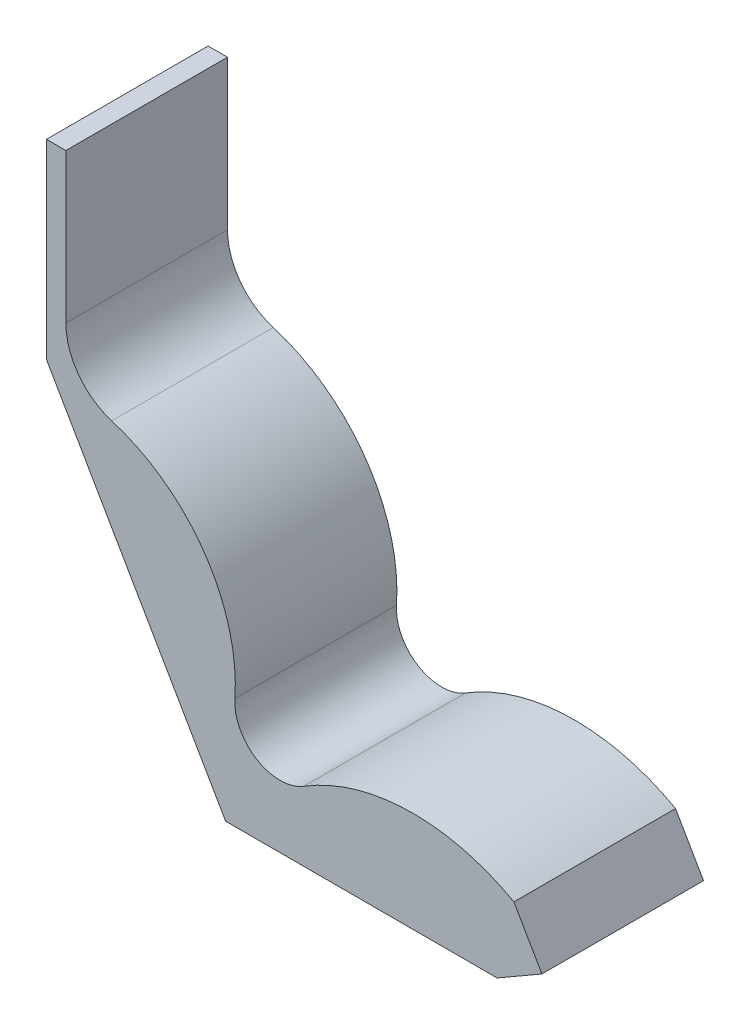
ISO-10303-21;
HEADER;
FILE_DESCRIPTION(('STEP AP214'),'2;1');
FILE_NAME('part.step','',(''),(''),'','','');
FILE_SCHEMA(('AUTOMOTIVE_DESIGN { 1 0 10303 214 1 1 1 1 }'));
ENDSEC;
DATA;
#1=APPLICATION_CONTEXT('core data for automotive mechanical design processes');
#2=APPLICATION_PROTOCOL_DEFINITION('international standard','automotive_design',2000,#1);
#3=PRODUCT_CONTEXT('',#1,'mechanical');
#4=PRODUCT('Part','Part','',(#3));
#5=PRODUCT_RELATED_PRODUCT_CATEGORY('part','',(#4));
#6=PRODUCT_DEFINITION_FORMATION('','',#4);
#7=PRODUCT_DEFINITION_CONTEXT('part definition',#1,'design');
#8=PRODUCT_DEFINITION('design','',#6,#7);
#9=PRODUCT_DEFINITION_SHAPE('','',#8);
#10=(LENGTH_UNIT() NAMED_UNIT(*) SI_UNIT(.MILLI.,.METRE.));
#11=(NAMED_UNIT(*) PLANE_ANGLE_UNIT() SI_UNIT($,.RADIAN.));
#12=(NAMED_UNIT(*) SI_UNIT($,.STERADIAN.) SOLID_ANGLE_UNIT());
#13=UNCERTAINTY_MEASURE_WITH_UNIT(LENGTH_MEASURE(1.E-05),#10,'distance_accuracy_value','');
#14=(GEOMETRIC_REPRESENTATION_CONTEXT(3) GLOBAL_UNCERTAINTY_ASSIGNED_CONTEXT((#13)) GLOBAL_UNIT_ASSIGNED_CONTEXT((#10,
#11,#12)) REPRESENTATION_CONTEXT('',''));
#15=CARTESIAN_POINT('',(0.,0.,0.));
#16=DIRECTION('',(0.,0.,1.));
#17=DIRECTION('',(1.,0.,0.));
#18=AXIS2_PLACEMENT_3D('',#15,#16,#17);
#19=CARTESIAN_POINT('',(-277.128129211019,480.,250.));
#20=DIRECTION('',(1.,0.,0.));
#21=DIRECTION('',(0.,1.,0.));
#22=AXIS2_PLACEMENT_3D('',#19,#20,#21);
#23=PLANE('',#22);
#24=DIRECTION('',(0.,-1.,0.));
#25=VECTOR('',#24,1.);
#26=CARTESIAN_POINT('',(-277.128129211019,480.,0.));
#27=LINE('',#26,#25);
#28=CARTESIAN_POINT('',(-277.128129211019,775.,0.));
#29=VERTEX_POINT('',#28);
#30=CARTESIAN_POINT('',(-277.128129211019,480.,0.));
#31=VERTEX_POINT('',#30);
#32=EDGE_CURVE('E152',#29,#31,#27,.T.);
#33=ORIENTED_EDGE('',*,*,#32,.T.);
#34=DIRECTION('',(0.,0.,-1.));
#35=VECTOR('',#34,1.);
#36=CARTESIAN_POINT('',(-277.128129211019,480.,250.));
#37=LINE('',#36,#35);
#38=CARTESIAN_POINT('',(-277.128129211019,480.,250.));
#39=VERTEX_POINT('',#38);
#40=EDGE_CURVE('E11',#39,#31,#37,.T.);
#41=ORIENTED_EDGE('',*,*,#40,.F.);
#42=DIRECTION('',(0.,-1.,0.));
#43=VECTOR('',#42,1.);
#44=CARTESIAN_POINT('',(-277.128129211019,480.,250.));
#45=LINE('',#44,#43);
#46=CARTESIAN_POINT('',(-277.128129211019,775.,250.));
#47=VERTEX_POINT('',#46);
#48=EDGE_CURVE('E172',#47,#39,#45,.T.);
#49=ORIENTED_EDGE('',*,*,#48,.F.);
#50=DIRECTION('',(0.,0.,-1.));
#51=VECTOR('',#50,1.);
#52=CARTESIAN_POINT('',(-277.128129211019,775.,250.));
#53=LINE('',#52,#51);
#54=EDGE_CURVE('E148',#47,#29,#53,.T.);
#55=ORIENTED_EDGE('',*,*,#54,.T.);
#56=EDGE_LOOP('',(#33,#41,#49,#55));
#57=FACE_BOUND('',#56,.T.);
#58=ADVANCED_FACE('F38',(#57),#23,.F.);
#59=CARTESIAN_POINT('',(-277.128129211019,480.,250.));
#60=DIRECTION('',(0.86602540378444,0.499999999999998,0.));
#61=DIRECTION('',(-0.499999999999998,0.86602540378444,0.));
#62=AXIS2_PLACEMENT_3D('',#59,#60,#61);
#63=PLANE('',#62);
#64=DIRECTION('',(0.499999999999998,-0.86602540378444,0.));
#65=VECTOR('',#64,1.);
#66=CARTESIAN_POINT('',(-277.128129211019,480.,0.));
#67=LINE('',#66,#65);
#68=CARTESIAN_POINT('',(0.,0.,0.));
#69=VERTEX_POINT('',#68);
#70=EDGE_CURVE('E155',#31,#69,#67,.T.);
#71=ORIENTED_EDGE('',*,*,#70,.T.);
#72=DIRECTION('',(0.,0.,-1.));
#73=VECTOR('',#72,1.);
#74=CARTESIAN_POINT('',(0.,0.,250.));
#75=LINE('',#74,#73);
#76=CARTESIAN_POINT('',(0.,0.,250.));
#77=VERTEX_POINT('',#76);
#78=EDGE_CURVE('E46',#77,#69,#75,.T.);
#79=ORIENTED_EDGE('',*,*,#78,.F.);
#80=DIRECTION('',(0.499999999999998,-0.86602540378444,0.));
#81=VECTOR('',#80,1.);
#82=CARTESIAN_POINT('',(-277.128129211019,480.,250.));
#83=LINE('',#82,#81);
#84=EDGE_CURVE('E106',#39,#77,#83,.T.);
#85=ORIENTED_EDGE('',*,*,#84,.F.);
#86=ORIENTED_EDGE('',*,*,#40,.T.);
#87=EDGE_LOOP('',(#71,#79,#85,#86));
#88=FACE_BOUND('',#87,.T.);
#89=ADVANCED_FACE('F244',(#88),#63,.F.);
#90=CARTESIAN_POINT('',(0.,0.,250.));
#91=DIRECTION('',(0.,1.,0.));
#92=DIRECTION('',(0.,0.,1.));
#93=AXIS2_PLACEMENT_3D('',#90,#91,#92);
#94=PLANE('',#93);
#95=DIRECTION('',(1.,0.,0.));
#96=VECTOR('',#95,1.);
#97=CARTESIAN_POINT('',(0.,0.,0.));
#98=LINE('',#97,#96);
#99=CARTESIAN_POINT('',(420.,0.,0.));
#100=VERTEX_POINT('',#99);
#101=EDGE_CURVE('E157',#69,#100,#98,.T.);
#102=ORIENTED_EDGE('',*,*,#101,.T.);
#103=DIRECTION('',(0.,0.,-1.));
#104=VECTOR('',#103,1.);
#105=CARTESIAN_POINT('',(420.,0.,250.));
#106=LINE('',#105,#104);
#107=CARTESIAN_POINT('',(420.,0.,250.));
#108=VERTEX_POINT('',#107);
#109=EDGE_CURVE('E188',#108,#100,#106,.T.);
#110=ORIENTED_EDGE('',*,*,#109,.F.);
#111=DIRECTION('',(1.,0.,0.));
#112=VECTOR('',#111,1.);
#113=CARTESIAN_POINT('',(0.,0.,250.));
#114=LINE('',#113,#112);
#115=EDGE_CURVE('E196',#77,#108,#114,.T.);
#116=ORIENTED_EDGE('',*,*,#115,.F.);
#117=ORIENTED_EDGE('',*,*,#78,.T.);
#118=EDGE_LOOP('',(#102,#110,#116,#117));
#119=FACE_BOUND('',#118,.T.);
#120=ADVANCED_FACE('F194',(#119),#94,.F.);
#121=CARTESIAN_POINT('',(420.,0.,250.));
#122=DIRECTION('',(-0.500000000000002,0.866025403784438,0.));
#123=DIRECTION('',(-0.866025403784438,-0.500000000000002,0.));
#124=AXIS2_PLACEMENT_3D('',#121,#122,#123);
#125=PLANE('',#124);
#126=DIRECTION('',(0.866025403784438,0.500000000000002,0.));
#127=VECTOR('',#126,1.);
#128=CARTESIAN_POINT('',(420.,0.,0.));
#129=LINE('',#128,#127);
#130=CARTESIAN_POINT('',(489.282032302755,40.0000000000001,0.));
#131=VERTEX_POINT('',#130);
#132=EDGE_CURVE('E159',#100,#131,#129,.T.);
#133=ORIENTED_EDGE('',*,*,#132,.T.);
#134=DIRECTION('',(0.,0.,-1.));
#135=VECTOR('',#134,1.);
#136=CARTESIAN_POINT('',(489.282032302755,40.0000000000001,250.));
#137=LINE('',#136,#135);
#138=CARTESIAN_POINT('',(489.282032302755,40.0000000000001,250.));
#139=VERTEX_POINT('',#138);
#140=EDGE_CURVE('E185',#139,#131,#137,.T.);
#141=ORIENTED_EDGE('',*,*,#140,.F.);
#142=DIRECTION('',(0.866025403784438,0.500000000000002,0.));
#143=VECTOR('',#142,1.);
#144=CARTESIAN_POINT('',(420.,0.,250.));
#145=LINE('',#144,#143);
#146=EDGE_CURVE('E214',#108,#139,#145,.T.);
#147=ORIENTED_EDGE('',*,*,#146,.F.);
#148=ORIENTED_EDGE('',*,*,#109,.T.);
#149=EDGE_LOOP('',(#133,#141,#147,#148));
#150=FACE_BOUND('',#149,.T.);
#151=ADVANCED_FACE('F205',(#150),#125,.F.);
#152=CARTESIAN_POINT('',(489.282032302755,40.0000000000001,250.));
#153=DIRECTION('',(-0.866025403784438,-0.500000000000001,0.));
#154=DIRECTION('',(0.500000000000001,-0.866025403784438,0.));
#155=AXIS2_PLACEMENT_3D('',#152,#153,#154);
#156=PLANE('',#155);
#157=DIRECTION('',(-0.500000000000001,0.866025403784438,0.));
#158=VECTOR('',#157,1.);
#159=CARTESIAN_POINT('',(489.282032302755,40.0000000000001,0.));
#160=LINE('',#159,#158);
#161=CARTESIAN_POINT('',(445.980762113533,115.,0.));
#162=VERTEX_POINT('',#161);
#163=EDGE_CURVE('E161',#131,#162,#160,.T.);
#164=ORIENTED_EDGE('',*,*,#163,.T.);
#165=DIRECTION('',(0.,0.,-1.));
#166=VECTOR('',#165,1.);
#167=CARTESIAN_POINT('',(445.980762113533,115.,250.));
#168=LINE('',#167,#166);
#169=CARTESIAN_POINT('',(445.980762113533,115.,250.));
#170=VERTEX_POINT('',#169);
#171=EDGE_CURVE('E182',#170,#162,#168,.T.);
#172=ORIENTED_EDGE('',*,*,#171,.F.);
#173=DIRECTION('',(-0.500000000000001,0.866025403784438,0.));
#174=VECTOR('',#173,1.);
#175=CARTESIAN_POINT('',(489.282032302755,40.0000000000001,250.));
#176=LINE('',#175,#174);
#177=EDGE_CURVE('E211',#139,#170,#176,.T.);
#178=ORIENTED_EDGE('',*,*,#177,.F.);
#179=ORIENTED_EDGE('',*,*,#140,.T.);
#180=EDGE_LOOP('',(#164,#172,#178,#179));
#181=FACE_BOUND('',#180,.T.);
#182=ADVANCED_FACE('F209',(#181),#156,.F.);
#183=CARTESIAN_POINT('',(290.,-164.410096185663,250.));
#184=DIRECTION('',(0.,0.,-1.));
#185=DIRECTION('',(-1.,0.,0.));
#186=AXIS2_PLACEMENT_3D('',#183,#184,#185);
#187=CYLINDRICAL_SURFACE('',#186,320.);
#188=CARTESIAN_POINT('',(290.,-164.410096185663,0.));
#189=DIRECTION('',(0.,0.,1.));
#190=DIRECTION('',(1.,0.,0.));
#191=AXIS2_PLACEMENT_3D('',#188,#189,#190);
#192=CIRCLE('',#191,320.);
#193=CARTESIAN_POINT('',(121.149011162266,107.415847330624,0.));
#194=VERTEX_POINT('',#193);
#195=EDGE_CURVE('E163',#162,#194,#192,.T.);
#196=ORIENTED_EDGE('',*,*,#195,.T.);
#197=DIRECTION('',(0.,0.,-1.));
#198=VECTOR('',#197,1.);
#199=CARTESIAN_POINT('',(121.149011162266,107.415847330624,250.));
#200=LINE('',#199,#198);
#201=CARTESIAN_POINT('',(121.149011162266,107.415847330624,250.));
#202=VERTEX_POINT('',#201);
#203=EDGE_CURVE('E179',#202,#194,#200,.T.);
#204=ORIENTED_EDGE('',*,*,#203,.F.);
#205=CARTESIAN_POINT('',(290.,-164.410096185663,250.));
#206=DIRECTION('',(0.,0.,1.));
#207=DIRECTION('',(1.,0.,0.));
#208=AXIS2_PLACEMENT_3D('',#205,#206,#207);
#209=CIRCLE('',#208,320.);
#210=EDGE_CURVE('E213',#170,#202,#209,.T.);
#211=ORIENTED_EDGE('',*,*,#210,.F.);
#212=ORIENTED_EDGE('',*,*,#171,.T.);
#213=EDGE_LOOP('',(#196,#204,#211,#212));
#214=FACE_BOUND('',#213,.T.);
#215=ADVANCED_FACE('F257',(#214),#187,.T.);
#216=CARTESIAN_POINT('',(84.2128573540122,166.877772474812,250.));
#217=DIRECTION('',(0.,0.,-1.));
#218=DIRECTION('',(-1.,0.,0.));
#219=AXIS2_PLACEMENT_3D('',#216,#217,#218);
#220=CYLINDRICAL_SURFACE('',#219,70.);
#221=CARTESIAN_POINT('',(84.2128573540122,166.877772474812,0.));
#222=DIRECTION('',(0.,0.,-1.));
#223=DIRECTION('',(1.,0.,0.));
#224=AXIS2_PLACEMENT_3D('',#221,#222,#223);
#225=CIRCLE('',#224,70.);
#226=CARTESIAN_POINT('',(14.3749161340685,171.638231082939,0.));
#227=VERTEX_POINT('',#226);
#228=EDGE_CURVE('E165',#194,#227,#225,.T.);
#229=ORIENTED_EDGE('',*,*,#228,.T.);
#230=DIRECTION('',(0.,0.,-1.));
#231=VECTOR('',#230,1.);
#232=CARTESIAN_POINT('',(14.3749161340685,171.638231082939,250.));
#233=LINE('',#232,#231);
#234=CARTESIAN_POINT('',(14.3749161340685,171.638231082939,250.));
#235=VERTEX_POINT('',#234);
#236=EDGE_CURVE('E176',#235,#227,#233,.T.);
#237=ORIENTED_EDGE('',*,*,#236,.F.);
#238=CARTESIAN_POINT('',(84.2128573540122,166.877772474812,250.));
#239=DIRECTION('',(0.,0.,-1.));
#240=DIRECTION('',(1.,0.,0.));
#241=AXIS2_PLACEMENT_3D('',#238,#239,#240);
#242=CIRCLE('',#241,70.);
#243=EDGE_CURVE('E216',#202,#235,#242,.T.);
#244=ORIENTED_EDGE('',*,*,#243,.F.);
#245=ORIENTED_EDGE('',*,*,#203,.T.);
#246=EDGE_LOOP('',(#229,#237,#244,#245));
#247=FACE_BOUND('',#246,.T.);
#248=ADVANCED_FACE('F225',(#247),#220,.F.);
#249=CARTESIAN_POINT('',(-255.,190.,250.));
#250=DIRECTION('',(0.,0.,-1.));
#251=DIRECTION('',(-1.,0.,0.));
#252=AXIS2_PLACEMENT_3D('',#249,#250,#251);
#253=CYLINDRICAL_SURFACE('',#252,270.);
#254=CARTESIAN_POINT('',(-255.,190.,0.));
#255=DIRECTION('',(0.,0.,1.));
#256=DIRECTION('',(1.,0.,0.));
#257=AXIS2_PLACEMENT_3D('',#254,#255,#256);
#258=CIRCLE('',#257,270.);
#259=CARTESIAN_POINT('',(-176.282688883717,448.270371763047,0.));
#260=VERTEX_POINT('',#259);
#261=EDGE_CURVE('E167',#227,#260,#258,.T.);
#262=ORIENTED_EDGE('',*,*,#261,.T.);
#263=DIRECTION('',(0.,0.,-1.));
#264=VECTOR('',#263,1.);
#265=CARTESIAN_POINT('',(-176.282688883717,448.270371763047,250.));
#266=LINE('',#265,#264);
#267=CARTESIAN_POINT('',(-176.282688883717,448.270371763047,250.));
#268=VERTEX_POINT('',#267);
#269=EDGE_CURVE('E143',#268,#260,#266,.T.);
#270=ORIENTED_EDGE('',*,*,#269,.F.);
#271=CARTESIAN_POINT('',(-255.,190.,250.));
#272=DIRECTION('',(0.,0.,1.));
#273=DIRECTION('',(1.,0.,0.));
#274=AXIS2_PLACEMENT_3D('',#271,#272,#273);
#275=CIRCLE('',#274,270.);
#276=EDGE_CURVE('E134',#235,#268,#275,.T.);
#277=ORIENTED_EDGE('',*,*,#276,.F.);
#278=ORIENTED_EDGE('',*,*,#236,.T.);
#279=EDGE_LOOP('',(#262,#270,#277,#278));
#280=FACE_BOUND('',#279,.T.);
#281=ADVANCED_FACE('F229',(#280),#253,.T.);
#282=CARTESIAN_POINT('',(-147.128129211019,543.926065008619,250.));
#283=DIRECTION('',(0.,0.,-1.));
#284=DIRECTION('',(-1.,0.,0.));
#285=AXIS2_PLACEMENT_3D('',#282,#283,#284);
#286=CYLINDRICAL_SURFACE('',#285,100.);
#287=CARTESIAN_POINT('',(-147.128129211019,543.926065008619,0.));
#288=DIRECTION('',(0.,0.,-1.));
#289=DIRECTION('',(-1.,0.,0.));
#290=AXIS2_PLACEMENT_3D('',#287,#288,#289);
#291=CIRCLE('',#290,100.);
#292=CARTESIAN_POINT('',(-247.128129211019,543.926065008619,0.));
#293=VERTEX_POINT('',#292);
#294=EDGE_CURVE('E142',#260,#293,#291,.T.);
#295=ORIENTED_EDGE('',*,*,#294,.T.);
#296=DIRECTION('',(0.,0.,-1.));
#297=VECTOR('',#296,1.);
#298=CARTESIAN_POINT('',(-247.128129211019,543.926065008619,250.));
#299=LINE('',#298,#297);
#300=CARTESIAN_POINT('',(-247.128129211019,543.926065008619,250.));
#301=VERTEX_POINT('',#300);
#302=EDGE_CURVE('E139',#301,#293,#299,.T.);
#303=ORIENTED_EDGE('',*,*,#302,.F.);
#304=CARTESIAN_POINT('',(-147.128129211019,543.926065008619,250.));
#305=DIRECTION('',(0.,0.,-1.));
#306=DIRECTION('',(-1.,0.,0.));
#307=AXIS2_PLACEMENT_3D('',#304,#305,#306);
#308=CIRCLE('',#307,100.);
#309=EDGE_CURVE('E128',#268,#301,#308,.T.);
#310=ORIENTED_EDGE('',*,*,#309,.F.);
#311=ORIENTED_EDGE('',*,*,#269,.T.);
#312=EDGE_LOOP('',(#295,#303,#310,#311));
#313=FACE_BOUND('',#312,.T.);
#314=ADVANCED_FACE('F140',(#313),#286,.F.);
#315=CARTESIAN_POINT('',(-247.128129211019,775.,250.));
#316=DIRECTION('',(-1.,0.,0.));
#317=DIRECTION('',(0.,-1.,0.));
#318=AXIS2_PLACEMENT_3D('',#315,#316,#317);
#319=PLANE('',#318);
#320=DIRECTION('',(0.,1.,0.));
#321=VECTOR('',#320,1.);
#322=CARTESIAN_POINT('',(-247.128129211019,775.,0.));
#323=LINE('',#322,#321);
#324=CARTESIAN_POINT('',(-247.128129211019,775.,0.));
#325=VERTEX_POINT('',#324);
#326=EDGE_CURVE('E92',#293,#325,#323,.T.);
#327=ORIENTED_EDGE('',*,*,#326,.T.);
#328=DIRECTION('',(0.,0.,-1.));
#329=VECTOR('',#328,1.);
#330=CARTESIAN_POINT('',(-247.128129211019,775.,250.));
#331=LINE('',#330,#329);
#332=CARTESIAN_POINT('',(-247.128129211019,775.,250.));
#333=VERTEX_POINT('',#332);
#334=EDGE_CURVE('E144',#333,#325,#331,.T.);
#335=ORIENTED_EDGE('',*,*,#334,.F.);
#336=DIRECTION('',(0.,1.,0.));
#337=VECTOR('',#336,1.);
#338=CARTESIAN_POINT('',(-247.128129211019,775.,250.));
#339=LINE('',#338,#337);
#340=EDGE_CURVE('E132',#301,#333,#339,.T.);
#341=ORIENTED_EDGE('',*,*,#340,.F.);
#342=ORIENTED_EDGE('',*,*,#302,.T.);
#343=EDGE_LOOP('',(#327,#335,#341,#342));
#344=FACE_BOUND('',#343,.T.);
#345=ADVANCED_FACE('F146',(#344),#319,.F.);
#346=CARTESIAN_POINT('',(-277.128129211019,775.,250.));
#347=DIRECTION('',(0.,-1.,0.));
#348=DIRECTION('',(0.,0.,-1.));
#349=AXIS2_PLACEMENT_3D('',#346,#347,#348);
#350=PLANE('',#349);
#351=DIRECTION('',(-1.,0.,0.));
#352=VECTOR('',#351,1.);
#353=CARTESIAN_POINT('',(-277.128129211019,775.,0.));
#354=LINE('',#353,#352);
#355=EDGE_CURVE('E98',#325,#29,#354,.T.);
#356=ORIENTED_EDGE('',*,*,#355,.T.);
#357=ORIENTED_EDGE('',*,*,#54,.F.);
#358=DIRECTION('',(-1.,0.,0.));
#359=VECTOR('',#358,1.);
#360=CARTESIAN_POINT('',(-277.128129211019,775.,250.));
#361=LINE('',#360,#359);
#362=EDGE_CURVE('E54',#333,#47,#361,.T.);
#363=ORIENTED_EDGE('',*,*,#362,.F.);
#364=ORIENTED_EDGE('',*,*,#334,.T.);
#365=EDGE_LOOP('',(#356,#357,#363,#364));
#366=FACE_BOUND('',#365,.T.);
#367=ADVANCED_FACE('F233',(#366),#350,.F.);
#368=CARTESIAN_POINT('',(-147.128129211019,543.926065008619,250.));
#369=DIRECTION('',(0.,0.,-1.));
#370=DIRECTION('',(-1.,0.,0.));
#371=AXIS2_PLACEMENT_3D('',#368,#369,#370);
#372=PLANE('',#371);
#373=ORIENTED_EDGE('',*,*,#48,.T.);
#374=ORIENTED_EDGE('',*,*,#84,.T.);
#375=ORIENTED_EDGE('',*,*,#115,.T.);
#376=ORIENTED_EDGE('',*,*,#146,.T.);
#377=ORIENTED_EDGE('',*,*,#177,.T.);
#378=ORIENTED_EDGE('',*,*,#210,.T.);
#379=ORIENTED_EDGE('',*,*,#243,.T.);
#380=ORIENTED_EDGE('',*,*,#276,.T.);
#381=ORIENTED_EDGE('',*,*,#309,.T.);
#382=ORIENTED_EDGE('',*,*,#340,.T.);
#383=ORIENTED_EDGE('',*,*,#362,.T.);
#384=EDGE_LOOP('',(#373,#374,#375,#376,#377,#378,#379,#380,#381,#382,#383));
#385=FACE_BOUND('',#384,.T.);
#386=ADVANCED_FACE('F130',(#385),#372,.F.);
#387=CARTESIAN_POINT('',(-147.128129211019,543.926065008619,0.));
#388=DIRECTION('',(0.,0.,-1.));
#389=DIRECTION('',(-1.,0.,0.));
#390=AXIS2_PLACEMENT_3D('',#387,#388,#389);
#391=PLANE('',#390);
#392=ORIENTED_EDGE('',*,*,#32,.F.);
#393=ORIENTED_EDGE('',*,*,#355,.F.);
#394=ORIENTED_EDGE('',*,*,#326,.F.);
#395=ORIENTED_EDGE('',*,*,#294,.F.);
#396=ORIENTED_EDGE('',*,*,#261,.F.);
#397=ORIENTED_EDGE('',*,*,#228,.F.);
#398=ORIENTED_EDGE('',*,*,#195,.F.);
#399=ORIENTED_EDGE('',*,*,#163,.F.);
#400=ORIENTED_EDGE('',*,*,#132,.F.);
#401=ORIENTED_EDGE('',*,*,#101,.F.);
#402=ORIENTED_EDGE('',*,*,#70,.F.);
#403=EDGE_LOOP('',(#392,#393,#394,#395,#396,#397,#398,#399,#400,#401,#402));
#404=FACE_BOUND('',#403,.T.);
#405=ADVANCED_FACE('F200',(#404),#391,.T.);
#406=CLOSED_SHELL('',(#58,#89,#120,#151,#182,#215,#248,#281,#314,#345,#367,#386,#405));
#407=MANIFOLD_SOLID_BREP('B2',#406);
#408=ADVANCED_BREP_SHAPE_REPRESENTATION('',(#18,#407),#14);
#409=SHAPE_DEFINITION_REPRESENTATION(#9,#408);
ENDSEC;
END-ISO-10303-21;
